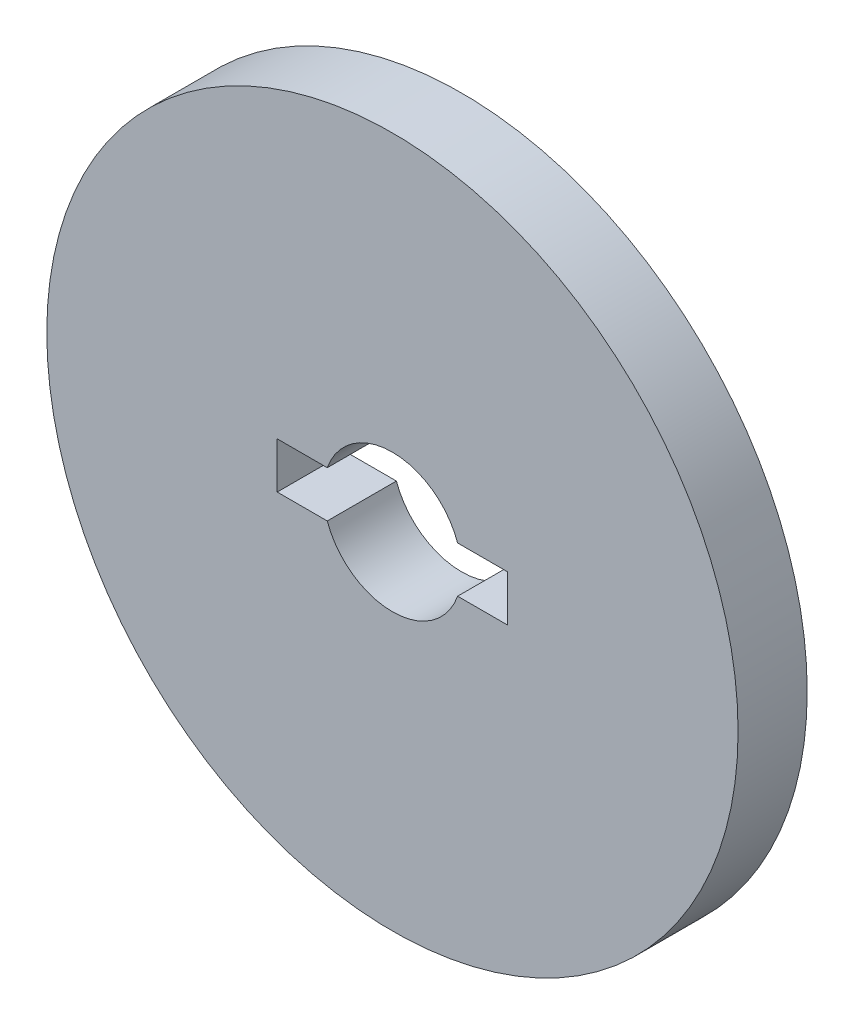
ISO-10303-21;
HEADER;
FILE_DESCRIPTION(('STEP AP214'),'2;1');
FILE_NAME('part.step','',(''),(''),'','','');
FILE_SCHEMA(('AUTOMOTIVE_DESIGN { 1 0 10303 214 1 1 1 1 }'));
ENDSEC;
DATA;
#1=APPLICATION_CONTEXT('core data for automotive mechanical design processes');
#2=APPLICATION_PROTOCOL_DEFINITION('international standard','automotive_design',2000,#1);
#3=PRODUCT_CONTEXT('',#1,'mechanical');
#4=PRODUCT('Part','Part','',(#3));
#5=PRODUCT_RELATED_PRODUCT_CATEGORY('part','',(#4));
#6=PRODUCT_DEFINITION_FORMATION('','',#4);
#7=PRODUCT_DEFINITION_CONTEXT('part definition',#1,'design');
#8=PRODUCT_DEFINITION('design','',#6,#7);
#9=PRODUCT_DEFINITION_SHAPE('','',#8);
#10=(LENGTH_UNIT() NAMED_UNIT(*) SI_UNIT(.MILLI.,.METRE.));
#11=(NAMED_UNIT(*) PLANE_ANGLE_UNIT() SI_UNIT($,.RADIAN.));
#12=(NAMED_UNIT(*) SI_UNIT($,.STERADIAN.) SOLID_ANGLE_UNIT());
#13=UNCERTAINTY_MEASURE_WITH_UNIT(LENGTH_MEASURE(1.E-05),#10,'distance_accuracy_value','');
#14=(GEOMETRIC_REPRESENTATION_CONTEXT(3) GLOBAL_UNCERTAINTY_ASSIGNED_CONTEXT((#13)) GLOBAL_UNIT_ASSIGNED_CONTEXT((#10,
#11,#12)) REPRESENTATION_CONTEXT('',''));
#15=CARTESIAN_POINT('',(0.,0.,0.));
#16=DIRECTION('',(0.,0.,1.));
#17=DIRECTION('',(1.,0.,0.));
#18=AXIS2_PLACEMENT_3D('',#15,#16,#17);
#19=CARTESIAN_POINT('',(0.,0.,30.));
#20=DIRECTION('',(0.,0.,-1.));
#21=DIRECTION('',(-1.,0.,0.));
#22=AXIS2_PLACEMENT_3D('',#19,#20,#21);
#23=CYLINDRICAL_SURFACE('',#22,30.);
#24=CARTESIAN_POINT('',(0.,0.,0.));
#25=DIRECTION('',(0.,0.,1.));
#26=DIRECTION('',(1.,0.,0.));
#27=AXIS2_PLACEMENT_3D('',#24,#25,#26);
#28=CIRCLE('',#27,30.);
#29=CARTESIAN_POINT('',(28.2842712474619,10.,0.));
#30=VERTEX_POINT('',#29);
#31=CARTESIAN_POINT('',(-28.2842712474619,10.,0.));
#32=VERTEX_POINT('',#31);
#33=EDGE_CURVE('E144',#30,#32,#28,.T.);
#34=ORIENTED_EDGE('',*,*,#33,.F.);
#35=DIRECTION('',(0.,0.,-1.));
#36=VECTOR('',#35,1.);
#37=CARTESIAN_POINT('',(28.2842712474619,10.,30.));
#38=LINE('',#37,#36);
#39=CARTESIAN_POINT('',(28.2842712474619,10.,30.));
#40=VERTEX_POINT('',#39);
#41=EDGE_CURVE('E11',#40,#30,#38,.T.);
#42=ORIENTED_EDGE('',*,*,#41,.F.);
#43=CARTESIAN_POINT('',(0.,0.,30.));
#44=DIRECTION('',(0.,0.,1.));
#45=DIRECTION('',(1.,0.,0.));
#46=AXIS2_PLACEMENT_3D('',#43,#44,#45);
#47=CIRCLE('',#46,30.);
#48=CARTESIAN_POINT('',(-28.2842712474619,10.,30.));
#49=VERTEX_POINT('',#48);
#50=EDGE_CURVE('E162',#40,#49,#47,.T.);
#51=ORIENTED_EDGE('',*,*,#50,.T.);
#52=DIRECTION('',(0.,0.,-1.));
#53=VECTOR('',#52,1.);
#54=CARTESIAN_POINT('',(-28.2842712474619,10.,30.));
#55=LINE('',#54,#53);
#56=EDGE_CURVE('E94',#49,#32,#55,.T.);
#57=ORIENTED_EDGE('',*,*,#56,.T.);
#58=EDGE_LOOP('',(#34,#42,#51,#57));
#59=FACE_BOUND('',#58,.T.);
#60=ADVANCED_FACE('F43',(#59),#23,.F.);
#61=CARTESIAN_POINT('',(0.,10.,30.));
#62=DIRECTION('',(0.,1.,0.));
#63=DIRECTION('',(-1.,0.,0.));
#64=AXIS2_PLACEMENT_3D('',#61,#62,#63);
#65=PLANE('',#64);
#66=DIRECTION('',(1.,0.,0.));
#67=VECTOR('',#66,1.);
#68=CARTESIAN_POINT('',(0.,10.,0.));
#69=LINE('',#68,#67);
#70=CARTESIAN_POINT('',(50.,10.,0.));
#71=VERTEX_POINT('',#70);
#72=EDGE_CURVE('E147',#30,#71,#69,.T.);
#73=ORIENTED_EDGE('',*,*,#72,.T.);
#74=DIRECTION('',(0.,0.,-1.));
#75=VECTOR('',#74,1.);
#76=CARTESIAN_POINT('',(50.,10.,30.));
#77=LINE('',#76,#75);
#78=CARTESIAN_POINT('',(50.,10.,30.));
#79=VERTEX_POINT('',#78);
#80=EDGE_CURVE('E52',#79,#71,#77,.T.);
#81=ORIENTED_EDGE('',*,*,#80,.F.);
#82=DIRECTION('',(1.,0.,0.));
#83=VECTOR('',#82,1.);
#84=CARTESIAN_POINT('',(0.,10.,30.));
#85=LINE('',#84,#83);
#86=EDGE_CURVE('E139',#40,#79,#85,.T.);
#87=ORIENTED_EDGE('',*,*,#86,.F.);
#88=ORIENTED_EDGE('',*,*,#41,.T.);
#89=EDGE_LOOP('',(#73,#81,#87,#88));
#90=FACE_BOUND('',#89,.T.);
#91=ADVANCED_FACE('F188',(#90),#65,.F.);
#92=CARTESIAN_POINT('',(50.,0.,30.));
#93=DIRECTION('',(1.,0.,0.));
#94=DIRECTION('',(0.,0.,-1.));
#95=AXIS2_PLACEMENT_3D('',#92,#93,#94);
#96=PLANE('',#95);
#97=DIRECTION('',(0.,-1.,0.));
#98=VECTOR('',#97,1.);
#99=CARTESIAN_POINT('',(50.,0.,0.));
#100=LINE('',#99,#98);
#101=CARTESIAN_POINT('',(50.,-10.,0.));
#102=VERTEX_POINT('',#101);
#103=EDGE_CURVE('E150',#71,#102,#100,.T.);
#104=ORIENTED_EDGE('',*,*,#103,.T.);
#105=DIRECTION('',(0.,0.,-1.));
#106=VECTOR('',#105,1.);
#107=CARTESIAN_POINT('',(50.,-10.,30.));
#108=LINE('',#107,#106);
#109=CARTESIAN_POINT('',(50.,-10.,30.));
#110=VERTEX_POINT('',#109);
#111=EDGE_CURVE('E168',#110,#102,#108,.T.);
#112=ORIENTED_EDGE('',*,*,#111,.F.);
#113=DIRECTION('',(0.,-1.,0.));
#114=VECTOR('',#113,1.);
#115=CARTESIAN_POINT('',(50.,0.,30.));
#116=LINE('',#115,#114);
#117=EDGE_CURVE('E175',#79,#110,#116,.T.);
#118=ORIENTED_EDGE('',*,*,#117,.F.);
#119=ORIENTED_EDGE('',*,*,#80,.T.);
#120=EDGE_LOOP('',(#104,#112,#118,#119));
#121=FACE_BOUND('',#120,.T.);
#122=ADVANCED_FACE('F45',(#121),#96,.F.);
#123=CARTESIAN_POINT('',(0.,-10.,30.));
#124=DIRECTION('',(0.,1.,0.));
#125=DIRECTION('',(-1.,0.,0.));
#126=AXIS2_PLACEMENT_3D('',#123,#124,#125);
#127=PLANE('',#126);
#128=DIRECTION('',(1.,0.,0.));
#129=VECTOR('',#128,1.);
#130=CARTESIAN_POINT('',(0.,-10.,0.));
#131=LINE('',#130,#129);
#132=CARTESIAN_POINT('',(28.2842712474619,-10.,0.));
#133=VERTEX_POINT('',#132);
#134=EDGE_CURVE('E154',#133,#102,#131,.T.);
#135=ORIENTED_EDGE('',*,*,#134,.F.);
#136=DIRECTION('',(0.,0.,-1.));
#137=VECTOR('',#136,1.);
#138=CARTESIAN_POINT('',(28.2842712474619,-10.,30.));
#139=LINE('',#138,#137);
#140=CARTESIAN_POINT('',(28.2842712474619,-10.,30.));
#141=VERTEX_POINT('',#140);
#142=EDGE_CURVE('E166',#141,#133,#139,.T.);
#143=ORIENTED_EDGE('',*,*,#142,.F.);
#144=DIRECTION('',(1.,0.,0.));
#145=VECTOR('',#144,1.);
#146=CARTESIAN_POINT('',(0.,-10.,30.));
#147=LINE('',#146,#145);
#148=EDGE_CURVE('E134',#141,#110,#147,.T.);
#149=ORIENTED_EDGE('',*,*,#148,.T.);
#150=ORIENTED_EDGE('',*,*,#111,.T.);
#151=EDGE_LOOP('',(#135,#143,#149,#150));
#152=FACE_BOUND('',#151,.T.);
#153=ADVANCED_FACE('F185',(#152),#127,.T.);
#154=CARTESIAN_POINT('',(-28.2842712474619,-10.,0.));
#155=VERTEX_POINT('',#154);
#156=EDGE_CURVE('E148',#155,#133,#28,.T.);
#157=ORIENTED_EDGE('',*,*,#156,.F.);
#158=DIRECTION('',(0.,0.,-1.));
#159=VECTOR('',#158,1.);
#160=CARTESIAN_POINT('',(-28.2842712474619,-10.,30.));
#161=LINE('',#160,#159);
#162=CARTESIAN_POINT('',(-28.2842712474619,-10.,30.));
#163=VERTEX_POINT('',#162);
#164=EDGE_CURVE('E124',#163,#155,#161,.T.);
#165=ORIENTED_EDGE('',*,*,#164,.F.);
#166=EDGE_CURVE('E132',#163,#141,#47,.T.);
#167=ORIENTED_EDGE('',*,*,#166,.T.);
#168=ORIENTED_EDGE('',*,*,#142,.T.);
#169=EDGE_LOOP('',(#157,#165,#167,#168));
#170=FACE_BOUND('',#169,.T.);
#171=ADVANCED_FACE('F196',(#170),#23,.F.);
#172=CARTESIAN_POINT('',(-50.,-10.,0.));
#173=VERTEX_POINT('',#172);
#174=EDGE_CURVE('E119',#173,#155,#131,.T.);
#175=ORIENTED_EDGE('',*,*,#174,.F.);
#176=DIRECTION('',(0.,0.,-1.));
#177=VECTOR('',#176,1.);
#178=CARTESIAN_POINT('',(-50.,-10.,30.));
#179=LINE('',#178,#177);
#180=CARTESIAN_POINT('',(-50.,-10.,30.));
#181=VERTEX_POINT('',#180);
#182=EDGE_CURVE('E114',#181,#173,#179,.T.);
#183=ORIENTED_EDGE('',*,*,#182,.F.);
#184=EDGE_CURVE('E117',#181,#163,#147,.T.);
#185=ORIENTED_EDGE('',*,*,#184,.T.);
#186=ORIENTED_EDGE('',*,*,#164,.T.);
#187=EDGE_LOOP('',(#175,#183,#185,#186));
#188=FACE_BOUND('',#187,.T.);
#189=ADVANCED_FACE('F116',(#188),#127,.T.);
#190=CARTESIAN_POINT('',(-50.,0.,30.));
#191=DIRECTION('',(1.,0.,0.));
#192=DIRECTION('',(0.,0.,-1.));
#193=AXIS2_PLACEMENT_3D('',#190,#191,#192);
#194=PLANE('',#193);
#195=DIRECTION('',(0.,-1.,0.));
#196=VECTOR('',#195,1.);
#197=CARTESIAN_POINT('',(-50.,0.,0.));
#198=LINE('',#197,#196);
#199=CARTESIAN_POINT('',(-50.,10.,0.));
#200=VERTEX_POINT('',#199);
#201=EDGE_CURVE('E157',#200,#173,#198,.T.);
#202=ORIENTED_EDGE('',*,*,#201,.F.);
#203=DIRECTION('',(0.,0.,-1.));
#204=VECTOR('',#203,1.);
#205=CARTESIAN_POINT('',(-50.,10.,30.));
#206=LINE('',#205,#204);
#207=CARTESIAN_POINT('',(-50.,10.,30.));
#208=VERTEX_POINT('',#207);
#209=EDGE_CURVE('E87',#208,#200,#206,.T.);
#210=ORIENTED_EDGE('',*,*,#209,.F.);
#211=DIRECTION('',(0.,-1.,0.));
#212=VECTOR('',#211,1.);
#213=CARTESIAN_POINT('',(-50.,0.,30.));
#214=LINE('',#213,#212);
#215=EDGE_CURVE('E129',#208,#181,#214,.T.);
#216=ORIENTED_EDGE('',*,*,#215,.T.);
#217=ORIENTED_EDGE('',*,*,#182,.T.);
#218=EDGE_LOOP('',(#202,#210,#216,#217));
#219=FACE_BOUND('',#218,.T.);
#220=ADVANCED_FACE('F135',(#219),#194,.T.);
#221=EDGE_CURVE('E151',#200,#32,#69,.T.);
#222=ORIENTED_EDGE('',*,*,#221,.T.);
#223=ORIENTED_EDGE('',*,*,#56,.F.);
#224=EDGE_CURVE('E60',#208,#49,#85,.T.);
#225=ORIENTED_EDGE('',*,*,#224,.F.);
#226=ORIENTED_EDGE('',*,*,#209,.T.);
#227=EDGE_LOOP('',(#222,#223,#225,#226));
#228=FACE_BOUND('',#227,.T.);
#229=ADVANCED_FACE('F191',(#228),#65,.F.);
#230=CARTESIAN_POINT('',(0.,0.,30.));
#231=DIRECTION('',(0.,0.,-1.));
#232=DIRECTION('',(-1.,0.,0.));
#233=AXIS2_PLACEMENT_3D('',#230,#231,#232);
#234=CYLINDRICAL_SURFACE('',#233,150.);
#235=CARTESIAN_POINT('',(0.,0.,30.));
#236=DIRECTION('',(0.,0.,1.));
#237=DIRECTION('',(1.,0.,0.));
#238=AXIS2_PLACEMENT_3D('',#235,#236,#237);
#239=CIRCLE('',#238,150.);
#240=CARTESIAN_POINT('',(150.,0.,30.));
#241=VERTEX_POINT('',#240);
#242=EDGE_CURVE('E137',#241,#241,#239,.T.);
#243=ORIENTED_EDGE('',*,*,#242,.F.);
#244=EDGE_LOOP('',(#243));
#245=FACE_BOUND('',#244,.T.);
#246=CARTESIAN_POINT('',(0.,0.,0.));
#247=DIRECTION('',(0.,0.,1.));
#248=DIRECTION('',(1.,0.,0.));
#249=AXIS2_PLACEMENT_3D('',#246,#247,#248);
#250=CIRCLE('',#249,150.);
#251=CARTESIAN_POINT('',(150.,0.,0.));
#252=VERTEX_POINT('',#251);
#253=EDGE_CURVE('E159',#252,#252,#250,.T.);
#254=ORIENTED_EDGE('',*,*,#253,.T.);
#255=EDGE_LOOP('',(#254));
#256=FACE_BOUND('',#255,.T.);
#257=ADVANCED_FACE('F200',(#245,#256),#234,.T.);
#258=CARTESIAN_POINT('',(0.,0.,30.));
#259=DIRECTION('',(0.,0.,1.));
#260=DIRECTION('',(1.,0.,0.));
#261=AXIS2_PLACEMENT_3D('',#258,#259,#260);
#262=PLANE('',#261);
#263=ORIENTED_EDGE('',*,*,#50,.F.);
#264=ORIENTED_EDGE('',*,*,#86,.T.);
#265=ORIENTED_EDGE('',*,*,#117,.T.);
#266=ORIENTED_EDGE('',*,*,#148,.F.);
#267=ORIENTED_EDGE('',*,*,#166,.F.);
#268=ORIENTED_EDGE('',*,*,#184,.F.);
#269=ORIENTED_EDGE('',*,*,#215,.F.);
#270=ORIENTED_EDGE('',*,*,#224,.T.);
#271=EDGE_LOOP('',(#263,#264,#265,#266,#267,#268,#269,#270));
#272=FACE_BOUND('',#271,.T.);
#273=ORIENTED_EDGE('',*,*,#242,.T.);
#274=EDGE_LOOP('',(#273));
#275=FACE_BOUND('',#274,.T.);
#276=ADVANCED_FACE('F127',(#272,#275),#262,.T.);
#277=CARTESIAN_POINT('',(0.,0.,0.));
#278=DIRECTION('',(0.,0.,1.));
#279=DIRECTION('',(1.,0.,0.));
#280=AXIS2_PLACEMENT_3D('',#277,#278,#279);
#281=PLANE('',#280);
#282=ORIENTED_EDGE('',*,*,#33,.T.);
#283=ORIENTED_EDGE('',*,*,#221,.F.);
#284=ORIENTED_EDGE('',*,*,#201,.T.);
#285=ORIENTED_EDGE('',*,*,#174,.T.);
#286=ORIENTED_EDGE('',*,*,#156,.T.);
#287=ORIENTED_EDGE('',*,*,#134,.T.);
#288=ORIENTED_EDGE('',*,*,#103,.F.);
#289=ORIENTED_EDGE('',*,*,#72,.F.);
#290=EDGE_LOOP('',(#282,#283,#284,#285,#286,#287,#288,#289));
#291=FACE_BOUND('',#290,.T.);
#292=ORIENTED_EDGE('',*,*,#253,.F.);
#293=EDGE_LOOP('',(#292));
#294=FACE_BOUND('',#293,.T.);
#295=ADVANCED_FACE('F179',(#291,#294),#281,.F.);
#296=CLOSED_SHELL('',(#60,#91,#122,#153,#171,#189,#220,#229,#257,#276,#295));
#297=MANIFOLD_SOLID_BREP('B2',#296);
#298=ADVANCED_BREP_SHAPE_REPRESENTATION('',(#18,#297),#14);
#299=SHAPE_DEFINITION_REPRESENTATION(#9,#298);
ENDSEC;
END-ISO-10303-21;
